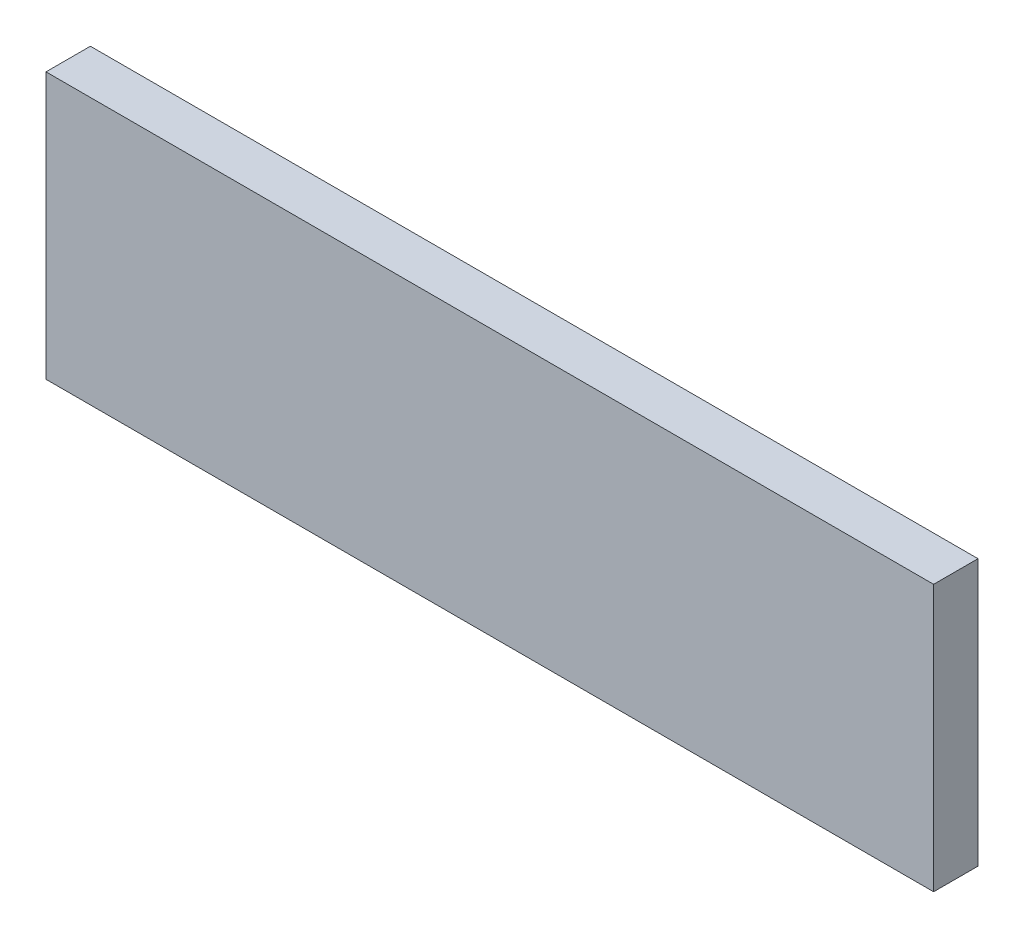
ISO-10303-21;
HEADER;
FILE_DESCRIPTION(('STEP AP214'),'2;1');
FILE_NAME('part.step','',(''),(''),'','','');
FILE_SCHEMA(('AUTOMOTIVE_DESIGN { 1 0 10303 214 1 1 1 1 }'));
ENDSEC;
DATA;
#1=APPLICATION_CONTEXT('core data for automotive mechanical design processes');
#2=APPLICATION_PROTOCOL_DEFINITION('international standard','automotive_design',2000,#1);
#3=PRODUCT_CONTEXT('',#1,'mechanical');
#4=PRODUCT('Part','Part','',(#3));
#5=PRODUCT_RELATED_PRODUCT_CATEGORY('part','',(#4));
#6=PRODUCT_DEFINITION_FORMATION('','',#4);
#7=PRODUCT_DEFINITION_CONTEXT('part definition',#1,'design');
#8=PRODUCT_DEFINITION('design','',#6,#7);
#9=PRODUCT_DEFINITION_SHAPE('','',#8);
#10=(LENGTH_UNIT() NAMED_UNIT(*) SI_UNIT(.MILLI.,.METRE.));
#11=(NAMED_UNIT(*) PLANE_ANGLE_UNIT() SI_UNIT($,.RADIAN.));
#12=(NAMED_UNIT(*) SI_UNIT($,.STERADIAN.) SOLID_ANGLE_UNIT());
#13=UNCERTAINTY_MEASURE_WITH_UNIT(LENGTH_MEASURE(1.E-05),#10,'distance_accuracy_value','');
#14=(GEOMETRIC_REPRESENTATION_CONTEXT(3) GLOBAL_UNCERTAINTY_ASSIGNED_CONTEXT((#13)) GLOBAL_UNIT_ASSIGNED_CONTEXT((#10,
#11,#12)) REPRESENTATION_CONTEXT('',''));
#15=CARTESIAN_POINT('',(0.,0.,0.));
#16=DIRECTION('',(0.,0.,1.));
#17=DIRECTION('',(1.,0.,0.));
#18=AXIS2_PLACEMENT_3D('',#15,#16,#17);
#19=CARTESIAN_POINT('',(0.,0.,100.));
#20=DIRECTION('',(-1.,0.,0.));
#21=DIRECTION('',(0.,-1.,0.));
#22=AXIS2_PLACEMENT_3D('',#19,#20,#21);
#23=PLANE('',#22);
#24=DIRECTION('',(0.,1.,0.));
#25=VECTOR('',#24,1.);
#26=CARTESIAN_POINT('',(0.,0.,0.));
#27=LINE('',#26,#25);
#28=CARTESIAN_POINT('',(0.,-600.,0.));
#29=VERTEX_POINT('',#28);
#30=CARTESIAN_POINT('',(0.,0.,0.));
#31=VERTEX_POINT('',#30);
#32=EDGE_CURVE('E95',#29,#31,#27,.T.);
#33=ORIENTED_EDGE('',*,*,#32,.T.);
#34=DIRECTION('',(0.,0.,-1.));
#35=VECTOR('',#34,1.);
#36=CARTESIAN_POINT('',(0.,0.,100.));
#37=LINE('',#36,#35);
#38=CARTESIAN_POINT('',(0.,0.,100.));
#39=VERTEX_POINT('',#38);
#40=EDGE_CURVE('E11',#39,#31,#37,.T.);
#41=ORIENTED_EDGE('',*,*,#40,.F.);
#42=DIRECTION('',(0.,1.,0.));
#43=VECTOR('',#42,1.);
#44=CARTESIAN_POINT('',(0.,0.,100.));
#45=LINE('',#44,#43);
#46=CARTESIAN_POINT('',(0.,-600.,100.));
#47=VERTEX_POINT('',#46);
#48=EDGE_CURVE('E83',#47,#39,#45,.T.);
#49=ORIENTED_EDGE('',*,*,#48,.F.);
#50=DIRECTION('',(0.,0.,-1.));
#51=VECTOR('',#50,1.);
#52=CARTESIAN_POINT('',(0.,-600.,100.));
#53=LINE('',#52,#51);
#54=EDGE_CURVE('E91',#47,#29,#53,.T.);
#55=ORIENTED_EDGE('',*,*,#54,.T.);
#56=EDGE_LOOP('',(#33,#41,#49,#55));
#57=FACE_BOUND('',#56,.T.);
#58=ADVANCED_FACE('F32',(#57),#23,.F.);
#59=CARTESIAN_POINT('',(0.,0.,100.));
#60=DIRECTION('',(0.,-1.,0.));
#61=DIRECTION('',(1.,0.,0.));
#62=AXIS2_PLACEMENT_3D('',#59,#60,#61);
#63=PLANE('',#62);
#64=DIRECTION('',(-1.,0.,0.));
#65=VECTOR('',#64,1.);
#66=CARTESIAN_POINT('',(0.,0.,0.));
#67=LINE('',#66,#65);
#68=CARTESIAN_POINT('',(-2000.,-2.44929359829471E-13,0.));
#69=VERTEX_POINT('',#68);
#70=EDGE_CURVE('E87',#31,#69,#67,.T.);
#71=ORIENTED_EDGE('',*,*,#70,.T.);
#72=DIRECTION('',(0.,0.,-1.));
#73=VECTOR('',#72,1.);
#74=CARTESIAN_POINT('',(-2000.,-2.44929359829471E-13,100.));
#75=LINE('',#74,#73);
#76=CARTESIAN_POINT('',(-2000.,-2.44929359829471E-13,100.));
#77=VERTEX_POINT('',#76);
#78=EDGE_CURVE('E40',#77,#69,#75,.T.);
#79=ORIENTED_EDGE('',*,*,#78,.F.);
#80=DIRECTION('',(-1.,0.,0.));
#81=VECTOR('',#80,1.);
#82=CARTESIAN_POINT('',(0.,0.,100.));
#83=LINE('',#82,#81);
#84=EDGE_CURVE('E78',#39,#77,#83,.T.);
#85=ORIENTED_EDGE('',*,*,#84,.F.);
#86=ORIENTED_EDGE('',*,*,#40,.T.);
#87=EDGE_LOOP('',(#71,#79,#85,#86));
#88=FACE_BOUND('',#87,.T.);
#89=ADVANCED_FACE('F86',(#88),#63,.F.);
#90=CARTESIAN_POINT('',(-2000.,-2.44929359829471E-13,100.));
#91=DIRECTION('',(1.,0.,0.));
#92=DIRECTION('',(0.,0.,-1.));
#93=AXIS2_PLACEMENT_3D('',#90,#91,#92);
#94=PLANE('',#93);
#95=DIRECTION('',(0.,-1.,0.));
#96=VECTOR('',#95,1.);
#97=CARTESIAN_POINT('',(-2000.,-2.44929359829471E-13,0.));
#98=LINE('',#97,#96);
#99=CARTESIAN_POINT('',(-2000.,-600.,0.));
#100=VERTEX_POINT('',#99);
#101=EDGE_CURVE('E65',#69,#100,#98,.T.);
#102=ORIENTED_EDGE('',*,*,#101,.T.);
#103=DIRECTION('',(0.,0.,-1.));
#104=VECTOR('',#103,1.);
#105=CARTESIAN_POINT('',(-2000.,-600.,100.));
#106=LINE('',#105,#104);
#107=CARTESIAN_POINT('',(-2000.,-600.,100.));
#108=VERTEX_POINT('',#107);
#109=EDGE_CURVE('E88',#108,#100,#106,.T.);
#110=ORIENTED_EDGE('',*,*,#109,.F.);
#111=DIRECTION('',(0.,-1.,0.));
#112=VECTOR('',#111,1.);
#113=CARTESIAN_POINT('',(-2000.,-2.44929359829471E-13,100.));
#114=LINE('',#113,#112);
#115=EDGE_CURVE('E81',#77,#108,#114,.T.);
#116=ORIENTED_EDGE('',*,*,#115,.F.);
#117=ORIENTED_EDGE('',*,*,#78,.T.);
#118=EDGE_LOOP('',(#102,#110,#116,#117));
#119=FACE_BOUND('',#118,.T.);
#120=ADVANCED_FACE('F89',(#119),#94,.F.);
#121=CARTESIAN_POINT('',(0.,-600.,100.));
#122=DIRECTION('',(0.,1.,0.));
#123=DIRECTION('',(-1.,0.,0.));
#124=AXIS2_PLACEMENT_3D('',#121,#122,#123);
#125=PLANE('',#124);
#126=DIRECTION('',(1.,0.,0.));
#127=VECTOR('',#126,1.);
#128=CARTESIAN_POINT('',(0.,-600.,0.));
#129=LINE('',#128,#127);
#130=EDGE_CURVE('E71',#100,#29,#129,.T.);
#131=ORIENTED_EDGE('',*,*,#130,.T.);
#132=ORIENTED_EDGE('',*,*,#54,.F.);
#133=DIRECTION('',(1.,0.,0.));
#134=VECTOR('',#133,1.);
#135=CARTESIAN_POINT('',(0.,-600.,100.));
#136=LINE('',#135,#134);
#137=EDGE_CURVE('E48',#108,#47,#136,.T.);
#138=ORIENTED_EDGE('',*,*,#137,.F.);
#139=ORIENTED_EDGE('',*,*,#109,.T.);
#140=EDGE_LOOP('',(#131,#132,#138,#139));
#141=FACE_BOUND('',#140,.T.);
#142=ADVANCED_FACE('F102',(#141),#125,.F.);
#143=CARTESIAN_POINT('',(0.,0.,100.));
#144=DIRECTION('',(0.,0.,-1.));
#145=DIRECTION('',(-1.,0.,0.));
#146=AXIS2_PLACEMENT_3D('',#143,#144,#145);
#147=PLANE('',#146);
#148=ORIENTED_EDGE('',*,*,#48,.T.);
#149=ORIENTED_EDGE('',*,*,#84,.T.);
#150=ORIENTED_EDGE('',*,*,#115,.T.);
#151=ORIENTED_EDGE('',*,*,#137,.T.);
#152=EDGE_LOOP('',(#148,#149,#150,#151));
#153=FACE_BOUND('',#152,.T.);
#154=ADVANCED_FACE('F79',(#153),#147,.F.);
#155=CARTESIAN_POINT('',(0.,0.,0.));
#156=DIRECTION('',(0.,0.,-1.));
#157=DIRECTION('',(-1.,0.,0.));
#158=AXIS2_PLACEMENT_3D('',#155,#156,#157);
#159=PLANE('',#158);
#160=ORIENTED_EDGE('',*,*,#32,.F.);
#161=ORIENTED_EDGE('',*,*,#130,.F.);
#162=ORIENTED_EDGE('',*,*,#101,.F.);
#163=ORIENTED_EDGE('',*,*,#70,.F.);
#164=EDGE_LOOP('',(#160,#161,#162,#163));
#165=FACE_BOUND('',#164,.T.);
#166=ADVANCED_FACE('F105',(#165),#159,.T.);
#167=CLOSED_SHELL('',(#58,#89,#120,#142,#154,#166));
#168=MANIFOLD_SOLID_BREP('B2',#167);
#169=ADVANCED_BREP_SHAPE_REPRESENTATION('',(#18,#168),#14);
#170=SHAPE_DEFINITION_REPRESENTATION(#9,#169);
ENDSEC;
END-ISO-10303-21;
